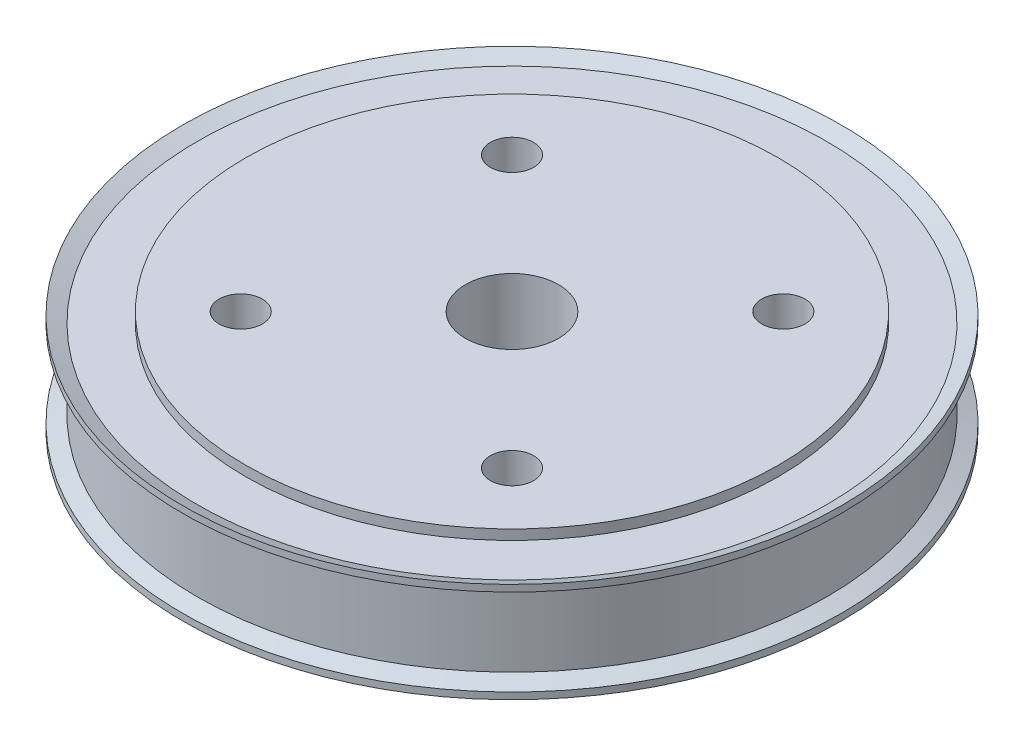
ISO-10303-21;
HEADER;
FILE_DESCRIPTION(('STEP AP214'),'2;1');
FILE_NAME('part.step','',(''),(''),'','','');
FILE_SCHEMA(('AUTOMOTIVE_DESIGN { 1 0 10303 214 1 1 1 1 }'));
ENDSEC;
DATA;
#1=APPLICATION_CONTEXT('core data for automotive mechanical design processes');
#2=APPLICATION_PROTOCOL_DEFINITION('international standard','automotive_design',2000,#1);
#3=PRODUCT_CONTEXT('',#1,'mechanical');
#4=PRODUCT('Part','Part','',(#3));
#5=PRODUCT_RELATED_PRODUCT_CATEGORY('part','',(#4));
#6=PRODUCT_DEFINITION_FORMATION('','',#4);
#7=PRODUCT_DEFINITION_CONTEXT('part definition',#1,'design');
#8=PRODUCT_DEFINITION('design','',#6,#7);
#9=PRODUCT_DEFINITION_SHAPE('','',#8);
#10=(LENGTH_UNIT() NAMED_UNIT(*) SI_UNIT(.MILLI.,.METRE.));
#11=(NAMED_UNIT(*) PLANE_ANGLE_UNIT() SI_UNIT($,.RADIAN.));
#12=(NAMED_UNIT(*) SI_UNIT($,.STERADIAN.) SOLID_ANGLE_UNIT());
#13=UNCERTAINTY_MEASURE_WITH_UNIT(LENGTH_MEASURE(1.E-05),#10,'distance_accuracy_value','');
#14=(GEOMETRIC_REPRESENTATION_CONTEXT(3) GLOBAL_UNCERTAINTY_ASSIGNED_CONTEXT((#13)) GLOBAL_UNIT_ASSIGNED_CONTEXT((#10,
#11,#12)) REPRESENTATION_CONTEXT('',''));
#15=CARTESIAN_POINT('',(0.,0.,0.));
#16=DIRECTION('',(0.,0.,1.));
#17=DIRECTION('',(1.,0.,0.));
#18=AXIS2_PLACEMENT_3D('',#15,#16,#17);
#19=CARTESIAN_POINT('',(0.,49.340027700831,0.));
#20=DIRECTION('',(0.,1.,0.));
#21=DIRECTION('',(0.,0.,1.));
#22=AXIS2_PLACEMENT_3D('',#19,#20,#21);
#23=CYLINDRICAL_SURFACE('',#22,40.);
#24=CARTESIAN_POINT('',(0.,8.,0.));
#25=DIRECTION('',(0.,1.,0.));
#26=DIRECTION('',(0.,0.,1.));
#27=AXIS2_PLACEMENT_3D('',#24,#25,#26);
#28=CIRCLE('',#27,40.);
#29=CARTESIAN_POINT('',(0.,8.,40.));
#30=VERTEX_POINT('',#29);
#31=EDGE_CURVE('E41',#30,#30,#28,.T.);
#32=ORIENTED_EDGE('',*,*,#31,.F.);
#33=EDGE_LOOP('',(#32));
#34=FACE_BOUND('',#33,.T.);
#35=CARTESIAN_POINT('',(0.,6.5,0.));
#36=DIRECTION('',(0.,-1.,0.));
#37=DIRECTION('',(1.,0.,0.));
#38=AXIS2_PLACEMENT_3D('',#35,#36,#37);
#39=CIRCLE('',#38,40.);
#40=CARTESIAN_POINT('',(40.,6.5,0.));
#41=VERTEX_POINT('',#40);
#42=EDGE_CURVE('E10',#41,#41,#39,.T.);
#43=ORIENTED_EDGE('',*,*,#42,.F.);
#44=EDGE_LOOP('',(#43));
#45=FACE_BOUND('',#44,.T.);
#46=ADVANCED_FACE('F30',(#34,#45),#23,.T.);
#47=CARTESIAN_POINT('',(0.,49.340027700831,0.));
#48=DIRECTION('',(0.,1.,0.));
#49=DIRECTION('',(0.,0.,1.));
#50=AXIS2_PLACEMENT_3D('',#47,#48,#49);
#51=CYLINDRICAL_SURFACE('',#50,40.);
#52=CARTESIAN_POINT('',(0.,-8.,0.));
#53=DIRECTION('',(0.,1.,0.));
#54=DIRECTION('',(0.,0.,1.));
#55=AXIS2_PLACEMENT_3D('',#52,#53,#54);
#56=CIRCLE('',#55,40.);
#57=CARTESIAN_POINT('',(0.,-8.,40.));
#58=VERTEX_POINT('',#57);
#59=EDGE_CURVE('E50',#58,#58,#56,.T.);
#60=ORIENTED_EDGE('',*,*,#59,.T.);
#61=EDGE_LOOP('',(#60));
#62=FACE_BOUND('',#61,.T.);
#63=CARTESIAN_POINT('',(0.,-6.5,0.));
#64=DIRECTION('',(0.,1.,0.));
#65=DIRECTION('',(-1.,0.,0.));
#66=AXIS2_PLACEMENT_3D('',#63,#64,#65);
#67=CIRCLE('',#66,40.);
#68=CARTESIAN_POINT('',(-40.,-6.5,0.));
#69=VERTEX_POINT('',#68);
#70=EDGE_CURVE('E37',#69,#69,#67,.T.);
#71=ORIENTED_EDGE('',*,*,#70,.F.);
#72=EDGE_LOOP('',(#71));
#73=FACE_BOUND('',#72,.T.);
#74=ADVANCED_FACE('F110',(#62,#73),#51,.T.);
#75=CARTESIAN_POINT('',(40.,8.,0.));
#76=DIRECTION('',(0.,-1.,0.));
#77=DIRECTION('',(0.,0.,-1.));
#78=AXIS2_PLACEMENT_3D('',#75,#76,#77);
#79=PLANE('',#78);
#80=CARTESIAN_POINT('',(-20.3750000000001,8.,-20.3749999999999));
#81=DIRECTION('',(0.,1.,0.));
#82=DIRECTION('',(0.,0.,1.));
#83=AXIS2_PLACEMENT_3D('',#80,#81,#82);
#84=CIRCLE('',#83,3.25);
#85=CARTESIAN_POINT('',(-20.3750000000001,8.,-17.1249999999999));
#86=VERTEX_POINT('',#85);
#87=EDGE_CURVE('E101',#86,#86,#84,.T.);
#88=ORIENTED_EDGE('',*,*,#87,.F.);
#89=EDGE_LOOP('',(#88));
#90=FACE_BOUND('',#89,.T.);
#91=CARTESIAN_POINT('',(20.3749999999999,8.,-20.3750000000001));
#92=DIRECTION('',(0.,1.,0.));
#93=DIRECTION('',(0.,0.,1.));
#94=AXIS2_PLACEMENT_3D('',#91,#92,#93);
#95=CIRCLE('',#94,3.25);
#96=CARTESIAN_POINT('',(20.3749999999999,8.,-17.1250000000001));
#97=VERTEX_POINT('',#96);
#98=EDGE_CURVE('E95',#97,#97,#95,.T.);
#99=ORIENTED_EDGE('',*,*,#98,.F.);
#100=EDGE_LOOP('',(#99));
#101=FACE_BOUND('',#100,.T.);
#102=CARTESIAN_POINT('',(20.3750000000001,8.,20.3749999999999));
#103=DIRECTION('',(0.,1.,0.));
#104=DIRECTION('',(0.,0.,1.));
#105=AXIS2_PLACEMENT_3D('',#102,#103,#104);
#106=CIRCLE('',#105,3.25);
#107=CARTESIAN_POINT('',(20.3750000000001,8.,23.6249999999999));
#108=VERTEX_POINT('',#107);
#109=EDGE_CURVE('E89',#108,#108,#106,.T.);
#110=ORIENTED_EDGE('',*,*,#109,.F.);
#111=EDGE_LOOP('',(#110));
#112=FACE_BOUND('',#111,.T.);
#113=CARTESIAN_POINT('',(-20.3749999999999,8.,20.3750000000001));
#114=DIRECTION('',(0.,1.,0.));
#115=DIRECTION('',(0.,0.,1.));
#116=AXIS2_PLACEMENT_3D('',#113,#114,#115);
#117=CIRCLE('',#116,3.25);
#118=CARTESIAN_POINT('',(-20.3749999999999,8.,23.6250000000001));
#119=VERTEX_POINT('',#118);
#120=EDGE_CURVE('E83',#119,#119,#117,.T.);
#121=ORIENTED_EDGE('',*,*,#120,.F.);
#122=EDGE_LOOP('',(#121));
#123=FACE_BOUND('',#122,.T.);
#124=CARTESIAN_POINT('',(0.,7.99999999999999,0.));
#125=DIRECTION('',(0.,1.,0.));
#126=DIRECTION('',(0.,0.,1.));
#127=AXIS2_PLACEMENT_3D('',#124,#125,#126);
#128=CIRCLE('',#127,7.);
#129=CARTESIAN_POINT('',(0.,7.99999999999999,7.));
#130=VERTEX_POINT('',#129);
#131=EDGE_CURVE('E56',#130,#130,#128,.T.);
#132=ORIENTED_EDGE('',*,*,#131,.F.);
#133=EDGE_LOOP('',(#132));
#134=FACE_BOUND('',#133,.T.);
#135=ORIENTED_EDGE('',*,*,#31,.T.);
#136=EDGE_LOOP('',(#135));
#137=FACE_BOUND('',#136,.T.);
#138=ADVANCED_FACE('F32',(#90,#101,#112,#123,#134,#137),#79,.F.);
#139=CARTESIAN_POINT('',(0.,49.340027700831,0.));
#140=DIRECTION('',(0.,1.,0.));
#141=DIRECTION('',(0.,0.,1.));
#142=AXIS2_PLACEMENT_3D('',#139,#140,#141);
#143=CYLINDRICAL_SURFACE('',#142,47.265);
#144=CARTESIAN_POINT('',(0.,5.5,0.));
#145=DIRECTION('',(0.,1.,0.));
#146=DIRECTION('',(0.,0.,1.));
#147=AXIS2_PLACEMENT_3D('',#144,#145,#146);
#148=CIRCLE('',#147,47.265);
#149=CARTESIAN_POINT('',(0.,5.5,47.265));
#150=VERTEX_POINT('',#149);
#151=EDGE_CURVE('E45',#150,#150,#148,.T.);
#152=ORIENTED_EDGE('',*,*,#151,.F.);
#153=EDGE_LOOP('',(#152));
#154=FACE_BOUND('',#153,.T.);
#155=CARTESIAN_POINT('',(0.,-5.5,0.));
#156=DIRECTION('',(0.,-1.,0.));
#157=DIRECTION('',(1.,0.,0.));
#158=AXIS2_PLACEMENT_3D('',#155,#156,#157);
#159=CIRCLE('',#158,47.265);
#160=CARTESIAN_POINT('',(47.265,-5.49999999999999,0.));
#161=VERTEX_POINT('',#160);
#162=EDGE_CURVE('E62',#161,#161,#159,.T.);
#163=ORIENTED_EDGE('',*,*,#162,.F.);
#164=EDGE_LOOP('',(#163));
#165=FACE_BOUND('',#164,.T.);
#166=ADVANCED_FACE('F109',(#154,#165),#143,.T.);
#167=CARTESIAN_POINT('',(40.,-8.,0.));
#168=DIRECTION('',(0.,1.,0.));
#169=DIRECTION('',(0.,0.,1.));
#170=AXIS2_PLACEMENT_3D('',#167,#168,#169);
#171=PLANE('',#170);
#172=CARTESIAN_POINT('',(-20.3750000000001,-8.,-20.3749999999999));
#173=DIRECTION('',(0.,1.,0.));
#174=DIRECTION('',(0.,0.,1.));
#175=AXIS2_PLACEMENT_3D('',#172,#173,#174);
#176=CIRCLE('',#175,3.25);
#177=CARTESIAN_POINT('',(-20.3750000000001,-8.,-17.1249999999999));
#178=VERTEX_POINT('',#177);
#179=EDGE_CURVE('E98',#178,#178,#176,.T.);
#180=ORIENTED_EDGE('',*,*,#179,.T.);
#181=EDGE_LOOP('',(#180));
#182=FACE_BOUND('',#181,.T.);
#183=CARTESIAN_POINT('',(20.3749999999999,-8.,-20.3750000000001));
#184=DIRECTION('',(0.,1.,0.));
#185=DIRECTION('',(0.,0.,1.));
#186=AXIS2_PLACEMENT_3D('',#183,#184,#185);
#187=CIRCLE('',#186,3.25);
#188=CARTESIAN_POINT('',(20.3749999999999,-8.,-17.1250000000001));
#189=VERTEX_POINT('',#188);
#190=EDGE_CURVE('E92',#189,#189,#187,.T.);
#191=ORIENTED_EDGE('',*,*,#190,.T.);
#192=EDGE_LOOP('',(#191));
#193=FACE_BOUND('',#192,.T.);
#194=CARTESIAN_POINT('',(20.3750000000001,-8.,20.3749999999999));
#195=DIRECTION('',(0.,1.,0.));
#196=DIRECTION('',(0.,0.,1.));
#197=AXIS2_PLACEMENT_3D('',#194,#195,#196);
#198=CIRCLE('',#197,3.25);
#199=CARTESIAN_POINT('',(20.3750000000001,-8.,23.6249999999999));
#200=VERTEX_POINT('',#199);
#201=EDGE_CURVE('E86',#200,#200,#198,.T.);
#202=ORIENTED_EDGE('',*,*,#201,.T.);
#203=EDGE_LOOP('',(#202));
#204=FACE_BOUND('',#203,.T.);
#205=CARTESIAN_POINT('',(-20.3749999999999,-8.,20.3750000000001));
#206=DIRECTION('',(0.,1.,0.));
#207=DIRECTION('',(0.,0.,1.));
#208=AXIS2_PLACEMENT_3D('',#205,#206,#207);
#209=CIRCLE('',#208,3.25);
#210=CARTESIAN_POINT('',(-20.3749999999999,-8.,23.6250000000001));
#211=VERTEX_POINT('',#210);
#212=EDGE_CURVE('E80',#211,#211,#209,.T.);
#213=ORIENTED_EDGE('',*,*,#212,.T.);
#214=EDGE_LOOP('',(#213));
#215=FACE_BOUND('',#214,.T.);
#216=ORIENTED_EDGE('',*,*,#59,.F.);
#217=EDGE_LOOP('',(#216));
#218=FACE_BOUND('',#217,.T.);
#219=CARTESIAN_POINT('',(0.,-8.,0.));
#220=DIRECTION('',(0.,1.,0.));
#221=DIRECTION('',(0.,0.,1.));
#222=AXIS2_PLACEMENT_3D('',#219,#220,#221);
#223=CIRCLE('',#222,7.00000000000001);
#224=CARTESIAN_POINT('',(0.,-8.,7.00000000000001));
#225=VERTEX_POINT('',#224);
#226=EDGE_CURVE('E53',#225,#225,#223,.T.);
#227=ORIENTED_EDGE('',*,*,#226,.T.);
#228=EDGE_LOOP('',(#227));
#229=FACE_BOUND('',#228,.T.);
#230=ADVANCED_FACE('F130',(#182,#193,#204,#215,#218,#229),#171,.F.);
#231=CARTESIAN_POINT('',(0.,49.340027700831,0.));
#232=DIRECTION('',(0.,1.,0.));
#233=DIRECTION('',(0.,0.,1.));
#234=AXIS2_PLACEMENT_3D('',#231,#232,#233);
#235=CYLINDRICAL_SURFACE('',#234,7.00000000000001);
#236=ORIENTED_EDGE('',*,*,#226,.F.);
#237=EDGE_LOOP('',(#236));
#238=FACE_BOUND('',#237,.T.);
#239=ORIENTED_EDGE('',*,*,#131,.T.);
#240=EDGE_LOOP('',(#239));
#241=FACE_BOUND('',#240,.T.);
#242=ADVANCED_FACE('F135',(#238,#241),#235,.F.);
#243=CARTESIAN_POINT('',(0.,0.,0.));
#244=DIRECTION('',(0.,-1.,0.));
#245=DIRECTION('',(1.,0.,0.));
#246=AXIS2_PLACEMENT_3D('',#243,#244,#245);
#247=CYLINDRICAL_SURFACE('',#246,49.5);
#248=CARTESIAN_POINT('',(0.,-7.5,0.));
#249=DIRECTION('',(0.,-1.,0.));
#250=DIRECTION('',(1.,0.,0.));
#251=AXIS2_PLACEMENT_3D('',#248,#249,#250);
#252=CIRCLE('',#251,49.5);
#253=CARTESIAN_POINT('',(49.5,-7.49999999999999,0.));
#254=VERTEX_POINT('',#253);
#255=EDGE_CURVE('E68',#254,#254,#252,.T.);
#256=ORIENTED_EDGE('',*,*,#255,.F.);
#257=EDGE_LOOP('',(#256));
#258=FACE_BOUND('',#257,.T.);
#259=CARTESIAN_POINT('',(0.,-6.49999999999999,0.));
#260=DIRECTION('',(0.,-1.,0.));
#261=DIRECTION('',(1.,0.,0.));
#262=AXIS2_PLACEMENT_3D('',#259,#260,#261);
#263=CIRCLE('',#262,49.5);
#264=CARTESIAN_POINT('',(49.5,-6.49999999999999,0.));
#265=VERTEX_POINT('',#264);
#266=EDGE_CURVE('E59',#265,#265,#263,.T.);
#267=ORIENTED_EDGE('',*,*,#266,.T.);
#268=EDGE_LOOP('',(#267));
#269=FACE_BOUND('',#268,.T.);
#270=ADVANCED_FACE('F139',(#258,#269),#247,.T.);
#271=CARTESIAN_POINT('',(0.,-5.5,0.));
#272=DIRECTION('',(0.,-1.,0.));
#273=DIRECTION('',(1.,0.,0.));
#274=AXIS2_PLACEMENT_3D('',#271,#272,#273);
#275=CONICAL_SURFACE('',#274,47.265,1.15008392439005);
#276=ORIENTED_EDGE('',*,*,#266,.F.);
#277=EDGE_LOOP('',(#276));
#278=FACE_BOUND('',#277,.T.);
#279=ORIENTED_EDGE('',*,*,#162,.T.);
#280=EDGE_LOOP('',(#279));
#281=FACE_BOUND('',#280,.T.);
#282=ADVANCED_FACE('F143',(#278,#281),#275,.T.);
#283=CARTESIAN_POINT('',(-47.265,-6.5,0.));
#284=DIRECTION('',(0.,1.,0.));
#285=DIRECTION('',(-1.,0.,0.));
#286=AXIS2_PLACEMENT_3D('',#283,#284,#285);
#287=PLANE('',#286);
#288=ORIENTED_EDGE('',*,*,#70,.T.);
#289=EDGE_LOOP('',(#288));
#290=FACE_BOUND('',#289,.T.);
#291=CARTESIAN_POINT('',(0.,-6.49999999999999,0.));
#292=DIRECTION('',(0.,-1.,0.));
#293=DIRECTION('',(1.,0.,0.));
#294=AXIS2_PLACEMENT_3D('',#291,#292,#293);
#295=CIRCLE('',#294,47.265);
#296=CARTESIAN_POINT('',(47.265,-6.49999999999999,0.));
#297=VERTEX_POINT('',#296);
#298=EDGE_CURVE('E65',#297,#297,#295,.T.);
#299=ORIENTED_EDGE('',*,*,#298,.T.);
#300=EDGE_LOOP('',(#299));
#301=FACE_BOUND('',#300,.T.);
#302=ADVANCED_FACE('F147',(#290,#301),#287,.F.);
#303=CARTESIAN_POINT('',(0.,-7.5,0.));
#304=DIRECTION('',(0.,-1.,0.));
#305=DIRECTION('',(1.,0.,0.));
#306=AXIS2_PLACEMENT_3D('',#303,#304,#305);
#307=CONICAL_SURFACE('',#306,49.5,1.15008392439005);
#308=ORIENTED_EDGE('',*,*,#298,.F.);
#309=EDGE_LOOP('',(#308));
#310=FACE_BOUND('',#309,.T.);
#311=ORIENTED_EDGE('',*,*,#255,.T.);
#312=EDGE_LOOP('',(#311));
#313=FACE_BOUND('',#312,.T.);
#314=ADVANCED_FACE('F151',(#310,#313),#307,.F.);
#315=CARTESIAN_POINT('',(0.,0.,0.));
#316=DIRECTION('',(0.,1.,0.));
#317=DIRECTION('',(1.,0.,0.));
#318=AXIS2_PLACEMENT_3D('',#315,#316,#317);
#319=CYLINDRICAL_SURFACE('',#318,49.5);
#320=CARTESIAN_POINT('',(0.,7.5,0.));
#321=DIRECTION('',(0.,-1.,0.));
#322=DIRECTION('',(1.,0.,0.));
#323=AXIS2_PLACEMENT_3D('',#320,#321,#322);
#324=CIRCLE('',#323,49.5);
#325=CARTESIAN_POINT('',(49.5,7.49999999999999,0.));
#326=VERTEX_POINT('',#325);
#327=EDGE_CURVE('E77',#326,#326,#324,.T.);
#328=ORIENTED_EDGE('',*,*,#327,.T.);
#329=EDGE_LOOP('',(#328));
#330=FACE_BOUND('',#329,.T.);
#331=CARTESIAN_POINT('',(0.,6.49999999999999,0.));
#332=DIRECTION('',(0.,-1.,0.));
#333=DIRECTION('',(1.,0.,0.));
#334=AXIS2_PLACEMENT_3D('',#331,#332,#333);
#335=CIRCLE('',#334,49.5);
#336=CARTESIAN_POINT('',(49.5,6.49999999999999,0.));
#337=VERTEX_POINT('',#336);
#338=EDGE_CURVE('E71',#337,#337,#335,.T.);
#339=ORIENTED_EDGE('',*,*,#338,.F.);
#340=EDGE_LOOP('',(#339));
#341=FACE_BOUND('',#340,.T.);
#342=ADVANCED_FACE('F154',(#330,#341),#319,.T.);
#343=CARTESIAN_POINT('',(0.,5.5,0.));
#344=DIRECTION('',(0.,1.,0.));
#345=DIRECTION('',(1.,0.,0.));
#346=AXIS2_PLACEMENT_3D('',#343,#344,#345);
#347=CONICAL_SURFACE('',#346,47.265,1.15008392439005);
#348=ORIENTED_EDGE('',*,*,#338,.T.);
#349=EDGE_LOOP('',(#348));
#350=FACE_BOUND('',#349,.T.);
#351=ORIENTED_EDGE('',*,*,#151,.T.);
#352=EDGE_LOOP('',(#351));
#353=FACE_BOUND('',#352,.T.);
#354=ADVANCED_FACE('F158',(#350,#353),#347,.T.);
#355=CARTESIAN_POINT('',(-47.265,6.5,0.));
#356=DIRECTION('',(0.,-1.,0.));
#357=DIRECTION('',(-1.,0.,0.));
#358=AXIS2_PLACEMENT_3D('',#355,#356,#357);
#359=PLANE('',#358);
#360=ORIENTED_EDGE('',*,*,#42,.T.);
#361=EDGE_LOOP('',(#360));
#362=FACE_BOUND('',#361,.T.);
#363=CARTESIAN_POINT('',(0.,6.49999999999999,0.));
#364=DIRECTION('',(0.,-1.,0.));
#365=DIRECTION('',(1.,0.,0.));
#366=AXIS2_PLACEMENT_3D('',#363,#364,#365);
#367=CIRCLE('',#366,47.265);
#368=CARTESIAN_POINT('',(47.265,6.49999999999999,0.));
#369=VERTEX_POINT('',#368);
#370=EDGE_CURVE('E74',#369,#369,#367,.T.);
#371=ORIENTED_EDGE('',*,*,#370,.F.);
#372=EDGE_LOOP('',(#371));
#373=FACE_BOUND('',#372,.T.);
#374=ADVANCED_FACE('F162',(#362,#373),#359,.F.);
#375=CARTESIAN_POINT('',(0.,7.5,0.));
#376=DIRECTION('',(0.,1.,0.));
#377=DIRECTION('',(1.,0.,0.));
#378=AXIS2_PLACEMENT_3D('',#375,#376,#377);
#379=CONICAL_SURFACE('',#378,49.5,1.15008392439005);
#380=ORIENTED_EDGE('',*,*,#370,.T.);
#381=EDGE_LOOP('',(#380));
#382=FACE_BOUND('',#381,.T.);
#383=ORIENTED_EDGE('',*,*,#327,.F.);
#384=EDGE_LOOP('',(#383));
#385=FACE_BOUND('',#384,.T.);
#386=ADVANCED_FACE('F166',(#382,#385),#379,.F.);
#387=CARTESIAN_POINT('',(-20.3749999999999,8.,20.3750000000001));
#388=DIRECTION('',(0.,1.,0.));
#389=DIRECTION('',(0.,0.,1.));
#390=AXIS2_PLACEMENT_3D('',#387,#388,#389);
#391=CYLINDRICAL_SURFACE('',#390,3.25);
#392=ORIENTED_EDGE('',*,*,#212,.F.);
#393=EDGE_LOOP('',(#392));
#394=FACE_BOUND('',#393,.T.);
#395=ORIENTED_EDGE('',*,*,#120,.T.);
#396=EDGE_LOOP('',(#395));
#397=FACE_BOUND('',#396,.T.);
#398=ADVANCED_FACE('F169',(#394,#397),#391,.F.);
#399=CARTESIAN_POINT('',(20.3750000000001,8.,20.3749999999999));
#400=DIRECTION('',(0.,1.,0.));
#401=DIRECTION('',(0.,0.,1.));
#402=AXIS2_PLACEMENT_3D('',#399,#400,#401);
#403=CYLINDRICAL_SURFACE('',#402,3.25);
#404=ORIENTED_EDGE('',*,*,#201,.F.);
#405=EDGE_LOOP('',(#404));
#406=FACE_BOUND('',#405,.T.);
#407=ORIENTED_EDGE('',*,*,#109,.T.);
#408=EDGE_LOOP('',(#407));
#409=FACE_BOUND('',#408,.T.);
#410=ADVANCED_FACE('F173',(#406,#409),#403,.F.);
#411=CARTESIAN_POINT('',(20.3749999999999,8.,-20.3750000000001));
#412=DIRECTION('',(0.,1.,0.));
#413=DIRECTION('',(0.,0.,1.));
#414=AXIS2_PLACEMENT_3D('',#411,#412,#413);
#415=CYLINDRICAL_SURFACE('',#414,3.25);
#416=ORIENTED_EDGE('',*,*,#190,.F.);
#417=EDGE_LOOP('',(#416));
#418=FACE_BOUND('',#417,.T.);
#419=ORIENTED_EDGE('',*,*,#98,.T.);
#420=EDGE_LOOP('',(#419));
#421=FACE_BOUND('',#420,.T.);
#422=ADVANCED_FACE('F177',(#418,#421),#415,.F.);
#423=CARTESIAN_POINT('',(-20.3750000000001,8.,-20.3749999999999));
#424=DIRECTION('',(0.,1.,0.));
#425=DIRECTION('',(0.,0.,1.));
#426=AXIS2_PLACEMENT_3D('',#423,#424,#425);
#427=CYLINDRICAL_SURFACE('',#426,3.25);
#428=ORIENTED_EDGE('',*,*,#179,.F.);
#429=EDGE_LOOP('',(#428));
#430=FACE_BOUND('',#429,.T.);
#431=ORIENTED_EDGE('',*,*,#87,.T.);
#432=EDGE_LOOP('',(#431));
#433=FACE_BOUND('',#432,.T.);
#434=ADVANCED_FACE('F105',(#430,#433),#427,.F.);
#435=CLOSED_SHELL('',(#46,#74,#138,#166,#230,#242,#270,#282,#302,#314,#342,#354,#374,#386,#398,
#410,#422,#434));
#436=MANIFOLD_SOLID_BREP('B2',#435);
#437=ADVANCED_BREP_SHAPE_REPRESENTATION('',(#18,#436),#14);
#438=SHAPE_DEFINITION_REPRESENTATION(#9,#437);
ENDSEC;
END-ISO-10303-21;
